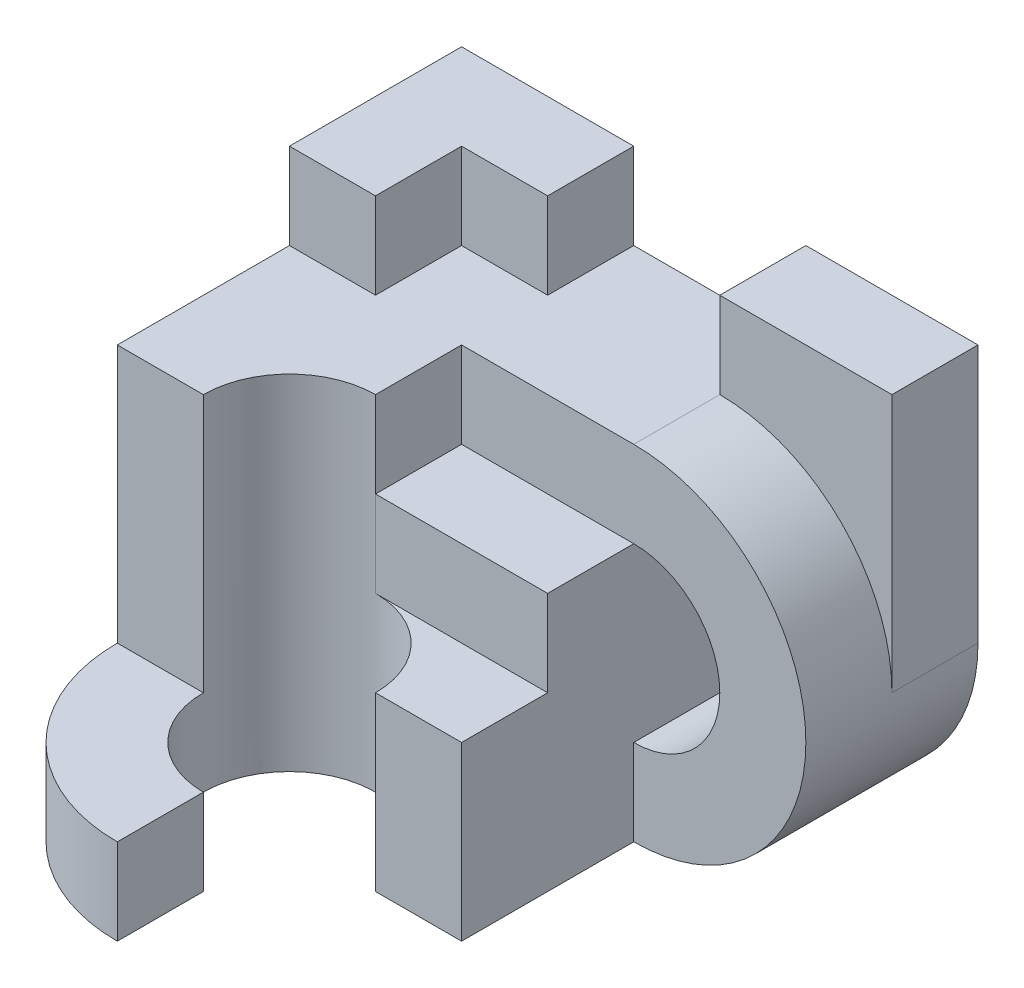
ISO-10303-21;
HEADER;
FILE_DESCRIPTION(('STEP AP214'),'2;1');
FILE_NAME('part.step','',(''),(''),'','','');
FILE_SCHEMA(('AUTOMOTIVE_DESIGN { 1 0 10303 214 1 1 1 1 }'));
ENDSEC;
DATA;
#1=APPLICATION_CONTEXT('core data for automotive mechanical design processes');
#2=APPLICATION_PROTOCOL_DEFINITION('international standard','automotive_design',2000,#1);
#3=PRODUCT_CONTEXT('',#1,'mechanical');
#4=PRODUCT('Part','Part','',(#3));
#5=PRODUCT_RELATED_PRODUCT_CATEGORY('part','',(#4));
#6=PRODUCT_DEFINITION_FORMATION('','',#4);
#7=PRODUCT_DEFINITION_CONTEXT('part definition',#1,'design');
#8=PRODUCT_DEFINITION('design','',#6,#7);
#9=PRODUCT_DEFINITION_SHAPE('','',#8);
#10=(LENGTH_UNIT() NAMED_UNIT(*) SI_UNIT(.MILLI.,.METRE.));
#11=(NAMED_UNIT(*) PLANE_ANGLE_UNIT() SI_UNIT($,.RADIAN.));
#12=(NAMED_UNIT(*) SI_UNIT($,.STERADIAN.) SOLID_ANGLE_UNIT());
#13=UNCERTAINTY_MEASURE_WITH_UNIT(LENGTH_MEASURE(1.E-05),#10,'distance_accuracy_value','');
#14=(GEOMETRIC_REPRESENTATION_CONTEXT(3) GLOBAL_UNCERTAINTY_ASSIGNED_CONTEXT((#13)) GLOBAL_UNIT_ASSIGNED_CONTEXT((#10,
#11,#12)) REPRESENTATION_CONTEXT('',''));
#15=CARTESIAN_POINT('',(0.,0.,0.));
#16=DIRECTION('',(0.,0.,1.));
#17=DIRECTION('',(1.,0.,0.));
#18=AXIS2_PLACEMENT_3D('',#15,#16,#17);
#19=CARTESIAN_POINT('',(7.5,12.5,10.));
#20=DIRECTION('',(0.,-1.,0.));
#21=DIRECTION('',(0.,0.,-1.));
#22=AXIS2_PLACEMENT_3D('',#19,#20,#21);
#23=PLANE('',#22);
#24=DIRECTION('',(1.,0.,0.));
#25=VECTOR('',#24,1.);
#26=CARTESIAN_POINT('',(-7.5,12.5,10.));
#27=LINE('',#26,#25);
#28=CARTESIAN_POINT('',(-12.5,12.5,10.));
#29=VERTEX_POINT('',#28);
#30=CARTESIAN_POINT('',(-7.5,12.5,10.));
#31=VERTEX_POINT('',#30);
#32=EDGE_CURVE('E568',#29,#31,#27,.T.);
#33=ORIENTED_EDGE('',*,*,#32,.F.);
#34=DIRECTION('',(0.,0.,1.));
#35=VECTOR('',#34,1.);
#36=CARTESIAN_POINT('',(-12.5,12.5,0.));
#37=LINE('',#36,#35);
#38=CARTESIAN_POINT('',(-12.5,12.5,20.));
#39=VERTEX_POINT('',#38);
#40=EDGE_CURVE('E222',#29,#39,#37,.T.);
#41=ORIENTED_EDGE('',*,*,#40,.T.);
#42=DIRECTION('',(1.,0.,0.));
#43=VECTOR('',#42,1.);
#44=CARTESIAN_POINT('',(-12.5,12.5,20.));
#45=LINE('',#44,#43);
#46=CARTESIAN_POINT('',(-7.5,12.5,20.));
#47=VERTEX_POINT('',#46);
#48=EDGE_CURVE('E362',#39,#47,#45,.T.);
#49=ORIENTED_EDGE('',*,*,#48,.T.);
#50=CARTESIAN_POINT('',(-2.5,12.5,20.));
#51=DIRECTION('',(0.,-1.,0.));
#52=DIRECTION('',(0.,0.,-1.));
#53=AXIS2_PLACEMENT_3D('',#50,#51,#52);
#54=CIRCLE('',#53,5.);
#55=CARTESIAN_POINT('',(-2.5,12.5,15.));
#56=VERTEX_POINT('',#55);
#57=EDGE_CURVE('E356',#47,#56,#54,.T.);
#58=ORIENTED_EDGE('',*,*,#57,.T.);
#59=DIRECTION('',(0.,0.,-1.));
#60=VECTOR('',#59,1.);
#61=CARTESIAN_POINT('',(-2.5,12.5,0.));
#62=LINE('',#61,#60);
#63=CARTESIAN_POINT('',(-2.5,12.5,10.));
#64=VERTEX_POINT('',#63);
#65=EDGE_CURVE('E339',#56,#64,#62,.T.);
#66=ORIENTED_EDGE('',*,*,#65,.T.);
#67=DIRECTION('',(-1.,0.,0.));
#68=VECTOR('',#67,1.);
#69=CARTESIAN_POINT('',(7.5,12.5,10.));
#70=LINE('',#69,#68);
#71=CARTESIAN_POINT('',(7.5,12.5,10.));
#72=VERTEX_POINT('',#71);
#73=EDGE_CURVE('E517',#72,#64,#70,.T.);
#74=ORIENTED_EDGE('',*,*,#73,.F.);
#75=DIRECTION('',(0.,0.,-1.));
#76=VECTOR('',#75,1.);
#77=CARTESIAN_POINT('',(7.5,12.5,10.));
#78=LINE('',#77,#76);
#79=CARTESIAN_POINT('',(7.5,12.5,5.));
#80=VERTEX_POINT('',#79);
#81=EDGE_CURVE('E477',#72,#80,#78,.T.);
#82=ORIENTED_EDGE('',*,*,#81,.T.);
#83=DIRECTION('',(0.,0.,1.));
#84=VECTOR('',#83,1.);
#85=CARTESIAN_POINT('',(7.5,12.5,10.));
#86=LINE('',#85,#84);
#87=CARTESIAN_POINT('',(7.5,12.5,0.));
#88=VERTEX_POINT('',#87);
#89=EDGE_CURVE('E418',#88,#80,#86,.T.);
#90=ORIENTED_EDGE('',*,*,#89,.F.);
#91=DIRECTION('',(-1.,0.,0.));
#92=VECTOR('',#91,1.);
#93=CARTESIAN_POINT('',(7.5,12.5,0.));
#94=LINE('',#93,#92);
#95=CARTESIAN_POINT('',(-2.5,12.5,0.));
#96=VERTEX_POINT('',#95);
#97=EDGE_CURVE('E529',#88,#96,#94,.T.);
#98=ORIENTED_EDGE('',*,*,#97,.T.);
#99=DIRECTION('',(0.,0.,-1.));
#100=VECTOR('',#99,1.);
#101=CARTESIAN_POINT('',(-2.5,12.5,0.));
#102=LINE('',#101,#100);
#103=CARTESIAN_POINT('',(-2.5,12.5,5.));
#104=VERTEX_POINT('',#103);
#105=EDGE_CURVE('E218',#104,#96,#102,.T.);
#106=ORIENTED_EDGE('',*,*,#105,.F.);
#107=DIRECTION('',(1.,0.,0.));
#108=VECTOR('',#107,1.);
#109=CARTESIAN_POINT('',(-2.5,12.5,5.));
#110=LINE('',#109,#108);
#111=CARTESIAN_POINT('',(-7.5,12.5,5.));
#112=VERTEX_POINT('',#111);
#113=EDGE_CURVE('E53',#112,#104,#110,.T.);
#114=ORIENTED_EDGE('',*,*,#113,.F.);
#115=DIRECTION('',(0.,0.,-1.));
#116=VECTOR('',#115,1.);
#117=CARTESIAN_POINT('',(-7.5,12.5,5.));
#118=LINE('',#117,#116);
#119=EDGE_CURVE('E48',#31,#112,#118,.T.);
#120=ORIENTED_EDGE('',*,*,#119,.F.);
#121=EDGE_LOOP('',(#33,#41,#49,#58,#66,#74,#82,#90,#98,#106,#114,#120));
#122=FACE_BOUND('',#121,.T.);
#123=ADVANCED_FACE('F33',(#122),#23,.F.);
#124=CARTESIAN_POINT('',(7.5,-7.5,15.));
#125=DIRECTION('',(-1.,0.,0.));
#126=DIRECTION('',(0.,0.,1.));
#127=AXIS2_PLACEMENT_3D('',#124,#125,#126);
#128=PLANE('',#127);
#129=DIRECTION('',(0.,1.,0.));
#130=VECTOR('',#129,1.);
#131=CARTESIAN_POINT('',(7.5,-7.5,0.));
#132=LINE('',#131,#130);
#133=CARTESIAN_POINT('',(7.5,-2.5,0.));
#134=VERTEX_POINT('',#133);
#135=CARTESIAN_POINT('',(7.5,7.5,0.));
#136=VERTEX_POINT('',#135);
#137=EDGE_CURVE('E467',#134,#136,#132,.T.);
#138=ORIENTED_EDGE('',*,*,#137,.T.);
#139=DIRECTION('',(0.,0.,1.));
#140=VECTOR('',#139,1.);
#141=CARTESIAN_POINT('',(7.5,7.5,-10.));
#142=LINE('',#141,#140);
#143=CARTESIAN_POINT('',(7.5,7.5,5.));
#144=VERTEX_POINT('',#143);
#145=EDGE_CURVE('E225',#136,#144,#142,.T.);
#146=ORIENTED_EDGE('',*,*,#145,.T.);
#147=DIRECTION('',(0.,0.,-1.));
#148=VECTOR('',#147,1.);
#149=CARTESIAN_POINT('',(7.5,7.5,10.));
#150=LINE('',#149,#148);
#151=CARTESIAN_POINT('',(7.5,7.5,10.));
#152=VERTEX_POINT('',#151);
#153=EDGE_CURVE('E464',#152,#144,#150,.T.);
#154=ORIENTED_EDGE('',*,*,#153,.F.);
#155=DIRECTION('',(0.,0.,-1.));
#156=VECTOR('',#155,1.);
#157=CARTESIAN_POINT('',(7.5,7.5,15.));
#158=LINE('',#157,#156);
#159=CARTESIAN_POINT('',(7.5,7.5,15.));
#160=VERTEX_POINT('',#159);
#161=EDGE_CURVE('E373',#160,#152,#158,.T.);
#162=ORIENTED_EDGE('',*,*,#161,.F.);
#163=DIRECTION('',(0.,1.,0.));
#164=VECTOR('',#163,1.);
#165=CARTESIAN_POINT('',(7.5,-7.5,15.));
#166=LINE('',#165,#164);
#167=CARTESIAN_POINT('',(7.5,2.5,15.));
#168=VERTEX_POINT('',#167);
#169=EDGE_CURVE('E346',#168,#160,#166,.T.);
#170=ORIENTED_EDGE('',*,*,#169,.F.);
#171=DIRECTION('',(0.,0.,-1.));
#172=VECTOR('',#171,1.);
#173=CARTESIAN_POINT('',(7.5,2.5,15.));
#174=LINE('',#173,#172);
#175=CARTESIAN_POINT('',(7.5,2.5,20.));
#176=VERTEX_POINT('',#175);
#177=EDGE_CURVE('E425',#176,#168,#174,.T.);
#178=ORIENTED_EDGE('',*,*,#177,.F.);
#179=DIRECTION('',(0.,-1.,0.));
#180=VECTOR('',#179,1.);
#181=CARTESIAN_POINT('',(7.5,2.5,20.));
#182=LINE('',#181,#180);
#183=CARTESIAN_POINT('',(7.5,-7.5,20.));
#184=VERTEX_POINT('',#183);
#185=EDGE_CURVE('E415',#176,#184,#182,.T.);
#186=ORIENTED_EDGE('',*,*,#185,.T.);
#187=DIRECTION('',(0.,0.,-1.));
#188=VECTOR('',#187,1.);
#189=CARTESIAN_POINT('',(7.5,-7.5,15.));
#190=LINE('',#189,#188);
#191=CARTESIAN_POINT('',(7.5,-7.5,10.));
#192=VERTEX_POINT('',#191);
#193=EDGE_CURVE('E347',#184,#192,#190,.T.);
#194=ORIENTED_EDGE('',*,*,#193,.T.);
#195=DIRECTION('',(0.,-1.,0.));
#196=VECTOR('',#195,1.);
#197=CARTESIAN_POINT('',(7.5,-2.5,10.));
#198=LINE('',#197,#196);
#199=CARTESIAN_POINT('',(7.5,-2.5,10.));
#200=VERTEX_POINT('',#199);
#201=EDGE_CURVE('E525',#200,#192,#198,.T.);
#202=ORIENTED_EDGE('',*,*,#201,.F.);
#203=DIRECTION('',(0.,0.,-1.));
#204=VECTOR('',#203,1.);
#205=CARTESIAN_POINT('',(7.5,-2.5,10.));
#206=LINE('',#205,#204);
#207=EDGE_CURVE('E478',#200,#134,#206,.T.);
#208=ORIENTED_EDGE('',*,*,#207,.T.);
#209=EDGE_LOOP('',(#138,#146,#154,#162,#170,#178,#186,#194,#202,#208));
#210=FACE_BOUND('',#209,.T.);
#211=ADVANCED_FACE('F35',(#210),#128,.F.);
#212=CARTESIAN_POINT('',(7.49999999999999,2.5,10.));
#213=DIRECTION('',(0.,0.,-1.));
#214=DIRECTION('',(-1.,0.,0.));
#215=AXIS2_PLACEMENT_3D('',#212,#213,#214);
#216=CYLINDRICAL_SURFACE('',#215,10.);
#217=CARTESIAN_POINT('',(7.49999999999999,2.5,5.));
#218=DIRECTION('',(0.,0.,-1.));
#219=DIRECTION('',(-1.,0.,0.));
#220=AXIS2_PLACEMENT_3D('',#217,#218,#219);
#221=CIRCLE('',#220,10.);
#222=CARTESIAN_POINT('',(17.5,2.5,5.));
#223=VERTEX_POINT('',#222);
#224=EDGE_CURVE('E421',#80,#223,#221,.T.);
#225=ORIENTED_EDGE('',*,*,#224,.F.);
#226=ORIENTED_EDGE('',*,*,#81,.F.);
#227=CARTESIAN_POINT('',(7.49999999999999,2.5,10.));
#228=DIRECTION('',(0.,0.,1.));
#229=DIRECTION('',(1.,0.,0.));
#230=AXIS2_PLACEMENT_3D('',#227,#228,#229);
#231=CIRCLE('',#230,10.);
#232=EDGE_CURVE('E514',#192,#72,#231,.T.);
#233=ORIENTED_EDGE('',*,*,#232,.F.);
#234=DIRECTION('',(0.,0.,-1.));
#235=VECTOR('',#234,1.);
#236=CARTESIAN_POINT('',(7.5,-7.5,10.));
#237=LINE('',#236,#235);
#238=CARTESIAN_POINT('',(7.5,-7.5,0.));
#239=VERTEX_POINT('',#238);
#240=EDGE_CURVE('E482',#192,#239,#237,.T.);
#241=ORIENTED_EDGE('',*,*,#240,.T.);
#242=CARTESIAN_POINT('',(7.49999999999999,2.5,0.));
#243=DIRECTION('',(0.,0.,1.));
#244=DIRECTION('',(1.,0.,0.));
#245=AXIS2_PLACEMENT_3D('',#242,#243,#244);
#246=CIRCLE('',#245,10.);
#247=CARTESIAN_POINT('',(17.5,2.5,0.));
#248=VERTEX_POINT('',#247);
#249=EDGE_CURVE('E513',#239,#248,#246,.T.);
#250=ORIENTED_EDGE('',*,*,#249,.T.);
#251=DIRECTION('',(0.,0.,-1.));
#252=VECTOR('',#251,1.);
#253=CARTESIAN_POINT('',(17.5,2.5,0.));
#254=LINE('',#253,#252);
#255=EDGE_CURVE('E444',#223,#248,#254,.T.);
#256=ORIENTED_EDGE('',*,*,#255,.F.);
#257=EDGE_LOOP('',(#225,#226,#233,#241,#250,#256));
#258=FACE_BOUND('',#257,.T.);
#259=ADVANCED_FACE('F307',(#258),#216,.T.);
#260=CARTESIAN_POINT('',(7.49999999999999,2.5,10.));
#261=DIRECTION('',(0.,0.,-1.));
#262=DIRECTION('',(-1.,0.,0.));
#263=AXIS2_PLACEMENT_3D('',#260,#261,#262);
#264=CYLINDRICAL_SURFACE('',#263,5.);
#265=CARTESIAN_POINT('',(7.49999999999999,2.5,5.));
#266=DIRECTION('',(0.,0.,-1.));
#267=DIRECTION('',(-1.,0.,0.));
#268=AXIS2_PLACEMENT_3D('',#265,#266,#267);
#269=CIRCLE('',#268,5.);
#270=CARTESIAN_POINT('',(12.5,2.5,5.));
#271=VERTEX_POINT('',#270);
#272=EDGE_CURVE('E11',#271,#144,#269,.F.);
#273=ORIENTED_EDGE('',*,*,#272,.F.);
#274=DIRECTION('',(0.,0.,-1.));
#275=VECTOR('',#274,1.);
#276=CARTESIAN_POINT('',(12.5,2.5,10.));
#277=LINE('',#276,#275);
#278=CARTESIAN_POINT('',(12.5,2.5,0.));
#279=VERTEX_POINT('',#278);
#280=EDGE_CURVE('E41',#271,#279,#277,.T.);
#281=ORIENTED_EDGE('',*,*,#280,.T.);
#282=CARTESIAN_POINT('',(7.49999999999999,2.5,0.));
#283=DIRECTION('',(0.,0.,-1.));
#284=DIRECTION('',(1.,0.,0.));
#285=AXIS2_PLACEMENT_3D('',#282,#283,#284);
#286=CIRCLE('',#285,5.);
#287=EDGE_CURVE('E518',#279,#134,#286,.T.);
#288=ORIENTED_EDGE('',*,*,#287,.T.);
#289=ORIENTED_EDGE('',*,*,#207,.F.);
#290=CARTESIAN_POINT('',(7.49999999999999,2.5,10.));
#291=DIRECTION('',(0.,0.,-1.));
#292=DIRECTION('',(1.,0.,0.));
#293=AXIS2_PLACEMENT_3D('',#290,#291,#292);
#294=CIRCLE('',#293,5.);
#295=EDGE_CURVE('E476',#152,#200,#294,.T.);
#296=ORIENTED_EDGE('',*,*,#295,.F.);
#297=ORIENTED_EDGE('',*,*,#153,.T.);
#298=EDGE_LOOP('',(#273,#281,#288,#289,#296,#297));
#299=FACE_BOUND('',#298,.T.);
#300=ADVANCED_FACE('F292',(#299),#264,.F.);
#301=CARTESIAN_POINT('',(-12.5,12.5,20.));
#302=DIRECTION('',(0.,0.,-1.));
#303=DIRECTION('',(-1.,0.,0.));
#304=AXIS2_PLACEMENT_3D('',#301,#302,#303);
#305=PLANE('',#304);
#306=DIRECTION('',(-1.,0.,0.));
#307=VECTOR('',#306,1.);
#308=CARTESIAN_POINT('',(-12.5,-2.5,20.));
#309=LINE('',#308,#307);
#310=CARTESIAN_POINT('',(-7.5,-2.5,20.));
#311=VERTEX_POINT('',#310);
#312=CARTESIAN_POINT('',(-12.5,-2.5,20.));
#313=VERTEX_POINT('',#312);
#314=EDGE_CURVE('E377',#311,#313,#309,.T.);
#315=ORIENTED_EDGE('',*,*,#314,.F.);
#316=DIRECTION('',(0.,-1.,0.));
#317=VECTOR('',#316,1.);
#318=CARTESIAN_POINT('',(-7.5,12.5,20.));
#319=LINE('',#318,#317);
#320=EDGE_CURVE('E355',#47,#311,#319,.T.);
#321=ORIENTED_EDGE('',*,*,#320,.F.);
#322=ORIENTED_EDGE('',*,*,#48,.F.);
#323=DIRECTION('',(0.,-1.,0.));
#324=VECTOR('',#323,1.);
#325=CARTESIAN_POINT('',(-12.5,12.5,20.));
#326=LINE('',#325,#324);
#327=EDGE_CURVE('E359',#39,#313,#326,.T.);
#328=ORIENTED_EDGE('',*,*,#327,.T.);
#329=EDGE_LOOP('',(#315,#321,#322,#328));
#330=FACE_BOUND('',#329,.T.);
#331=ADVANCED_FACE('F288',(#330),#305,.F.);
#332=CARTESIAN_POINT('',(-7.5,7.5,15.));
#333=DIRECTION('',(0.,-1.,0.));
#334=DIRECTION('',(0.,0.,-1.));
#335=AXIS2_PLACEMENT_3D('',#332,#333,#334);
#336=PLANE('',#335);
#337=DIRECTION('',(0.,0.,-1.));
#338=VECTOR('',#337,1.);
#339=CARTESIAN_POINT('',(-2.5,7.5,0.));
#340=LINE('',#339,#338);
#341=CARTESIAN_POINT('',(-2.5,7.5,15.));
#342=VERTEX_POINT('',#341);
#343=CARTESIAN_POINT('',(-2.5,7.5,10.));
#344=VERTEX_POINT('',#343);
#345=EDGE_CURVE('E331',#342,#344,#340,.T.);
#346=ORIENTED_EDGE('',*,*,#345,.F.);
#347=DIRECTION('',(-1.,0.,0.));
#348=VECTOR('',#347,1.);
#349=CARTESIAN_POINT('',(-7.5,7.5,15.));
#350=LINE('',#349,#348);
#351=EDGE_CURVE('E334',#160,#342,#350,.T.);
#352=ORIENTED_EDGE('',*,*,#351,.F.);
#353=ORIENTED_EDGE('',*,*,#161,.T.);
#354=DIRECTION('',(1.,0.,0.));
#355=VECTOR('',#354,1.);
#356=CARTESIAN_POINT('',(7.5,7.5,10.));
#357=LINE('',#356,#355);
#358=EDGE_CURVE('E337',#344,#152,#357,.T.);
#359=ORIENTED_EDGE('',*,*,#358,.F.);
#360=EDGE_LOOP('',(#346,#352,#353,#359));
#361=FACE_BOUND('',#360,.T.);
#362=ADVANCED_FACE('F291',(#361),#336,.F.);
#363=CARTESIAN_POINT('',(-7.5,-7.5,15.));
#364=DIRECTION('',(0.,1.,0.));
#365=DIRECTION('',(0.,0.,1.));
#366=AXIS2_PLACEMENT_3D('',#363,#364,#365);
#367=PLANE('',#366);
#368=DIRECTION('',(1.,0.,0.));
#369=VECTOR('',#368,1.);
#370=CARTESIAN_POINT('',(-7.5,-7.5,0.));
#371=LINE('',#370,#369);
#372=CARTESIAN_POINT('',(-12.5,-7.5,0.));
#373=VERTEX_POINT('',#372);
#374=EDGE_CURVE('E486',#373,#239,#371,.T.);
#375=ORIENTED_EDGE('',*,*,#374,.T.);
#376=ORIENTED_EDGE('',*,*,#240,.F.);
#377=ORIENTED_EDGE('',*,*,#193,.F.);
#378=DIRECTION('',(1.,0.,0.));
#379=VECTOR('',#378,1.);
#380=CARTESIAN_POINT('',(7.5,-7.5,20.));
#381=LINE('',#380,#379);
#382=CARTESIAN_POINT('',(2.5,-7.5,20.));
#383=VERTEX_POINT('',#382);
#384=EDGE_CURVE('E412',#383,#184,#381,.T.);
#385=ORIENTED_EDGE('',*,*,#384,.F.);
#386=CARTESIAN_POINT('',(-2.5,-7.5,20.));
#387=DIRECTION('',(0.,-1.,0.));
#388=DIRECTION('',(0.,0.,-1.));
#389=AXIS2_PLACEMENT_3D('',#386,#387,#388);
#390=CIRCLE('',#389,5.);
#391=CARTESIAN_POINT('',(-2.5,-7.5,25.));
#392=VERTEX_POINT('',#391);
#393=EDGE_CURVE('E366',#392,#383,#390,.T.);
#394=ORIENTED_EDGE('',*,*,#393,.F.);
#395=DIRECTION('',(0.,0.,-1.));
#396=VECTOR('',#395,1.);
#397=CARTESIAN_POINT('',(-2.5,-7.5,25.));
#398=LINE('',#397,#396);
#399=CARTESIAN_POINT('',(-2.5,-7.5,30.));
#400=VERTEX_POINT('',#399);
#401=EDGE_CURVE('E392',#400,#392,#398,.T.);
#402=ORIENTED_EDGE('',*,*,#401,.F.);
#403=CARTESIAN_POINT('',(-2.5,-7.5,20.));
#404=DIRECTION('',(0.,1.,0.));
#405=DIRECTION('',(0.,0.,1.));
#406=AXIS2_PLACEMENT_3D('',#403,#404,#405);
#407=CIRCLE('',#406,10.);
#408=CARTESIAN_POINT('',(-12.5,-7.5,20.));
#409=VERTEX_POINT('',#408);
#410=EDGE_CURVE('E389',#409,#400,#407,.T.);
#411=ORIENTED_EDGE('',*,*,#410,.F.);
#412=DIRECTION('',(0.,0.,1.));
#413=VECTOR('',#412,1.);
#414=CARTESIAN_POINT('',(-12.5,-7.5,0.));
#415=LINE('',#414,#413);
#416=EDGE_CURVE('E376',#373,#409,#415,.T.);
#417=ORIENTED_EDGE('',*,*,#416,.F.);
#418=EDGE_LOOP('',(#375,#376,#377,#385,#394,#402,#411,#417));
#419=FACE_BOUND('',#418,.T.);
#420=ADVANCED_FACE('F317',(#419),#367,.F.);
#421=CARTESIAN_POINT('',(0.,0.,15.));
#422=DIRECTION('',(0.,0.,-1.));
#423=DIRECTION('',(-1.,0.,0.));
#424=AXIS2_PLACEMENT_3D('',#421,#422,#423);
#425=PLANE('',#424);
#426=DIRECTION('',(0.,-1.,0.));
#427=VECTOR('',#426,1.);
#428=CARTESIAN_POINT('',(-2.5,12.5,15.));
#429=LINE('',#428,#427);
#430=CARTESIAN_POINT('',(-2.5,2.5,15.));
#431=VERTEX_POINT('',#430);
#432=EDGE_CURVE('E343',#342,#431,#429,.T.);
#433=ORIENTED_EDGE('',*,*,#432,.T.);
#434=DIRECTION('',(-1.,0.,0.));
#435=VECTOR('',#434,1.);
#436=CARTESIAN_POINT('',(-2.5,2.5,15.));
#437=LINE('',#436,#435);
#438=EDGE_CURVE('E417',#168,#431,#437,.T.);
#439=ORIENTED_EDGE('',*,*,#438,.F.);
#440=ORIENTED_EDGE('',*,*,#169,.T.);
#441=ORIENTED_EDGE('',*,*,#351,.T.);
#442=EDGE_LOOP('',(#433,#439,#440,#441));
#443=FACE_BOUND('',#442,.T.);
#444=ADVANCED_FACE('F314',(#443),#425,.F.);
#445=CARTESIAN_POINT('',(0.,0.,0.));
#446=DIRECTION('',(0.,0.,-1.));
#447=DIRECTION('',(-1.,0.,0.));
#448=AXIS2_PLACEMENT_3D('',#445,#446,#447);
#449=PLANE('',#448);
#450=CARTESIAN_POINT('',(12.5,2.5,0.));
#451=CARTESIAN_POINT('',(11.0355339059327,7.49999999999999,0.));
#452=CARTESIAN_POINT('',(7.5,7.5,0.));
#453=B_SPLINE_CURVE_WITH_KNOTS('',2,(#450,#451,#452),.UNSPECIFIED.,.F.,.F.,(3,3),(0.,1.),.UNSPECIFIED.);
#454=EDGE_CURVE('E448',#136,#279,#453,.F.);
#455=ORIENTED_EDGE('',*,*,#454,.F.);
#456=ORIENTED_EDGE('',*,*,#137,.F.);
#457=ORIENTED_EDGE('',*,*,#287,.F.);
#458=EDGE_LOOP('',(#455,#456,#457));
#459=FACE_BOUND('',#458,.T.);
#460=ORIENTED_EDGE('',*,*,#97,.F.);
#461=DIRECTION('',(0.,-1.,0.));
#462=VECTOR('',#461,1.);
#463=CARTESIAN_POINT('',(7.5,17.5,0.));
#464=LINE('',#463,#462);
#465=CARTESIAN_POINT('',(7.5,17.5,0.));
#466=VERTEX_POINT('',#465);
#467=EDGE_CURVE('E435',#466,#88,#464,.T.);
#468=ORIENTED_EDGE('',*,*,#467,.F.);
#469=DIRECTION('',(-1.,0.,0.));
#470=VECTOR('',#469,1.);
#471=CARTESIAN_POINT('',(17.5,17.5,0.));
#472=LINE('',#471,#470);
#473=CARTESIAN_POINT('',(17.5,17.5,0.));
#474=VERTEX_POINT('',#473);
#475=EDGE_CURVE('E452',#474,#466,#472,.T.);
#476=ORIENTED_EDGE('',*,*,#475,.F.);
#477=DIRECTION('',(0.,-1.,0.));
#478=VECTOR('',#477,1.);
#479=CARTESIAN_POINT('',(17.5,17.5,0.));
#480=LINE('',#479,#478);
#481=EDGE_CURVE('E433',#474,#248,#480,.T.);
#482=ORIENTED_EDGE('',*,*,#481,.T.);
#483=ORIENTED_EDGE('',*,*,#249,.F.);
#484=ORIENTED_EDGE('',*,*,#374,.F.);
#485=DIRECTION('',(0.,-1.,0.));
#486=VECTOR('',#485,1.);
#487=CARTESIAN_POINT('',(-12.5,12.5,0.));
#488=LINE('',#487,#486);
#489=CARTESIAN_POINT('',(-12.5,17.5,0.));
#490=VERTEX_POINT('',#489);
#491=EDGE_CURVE('E340',#490,#373,#488,.T.);
#492=ORIENTED_EDGE('',*,*,#491,.F.);
#493=DIRECTION('',(-1.,0.,0.));
#494=VECTOR('',#493,1.);
#495=CARTESIAN_POINT('',(-12.5,17.5,0.));
#496=LINE('',#495,#494);
#497=CARTESIAN_POINT('',(-2.5,17.5,0.));
#498=VERTEX_POINT('',#497);
#499=EDGE_CURVE('E215',#498,#490,#496,.T.);
#500=ORIENTED_EDGE('',*,*,#499,.F.);
#501=DIRECTION('',(0.,-1.,0.));
#502=VECTOR('',#501,1.);
#503=CARTESIAN_POINT('',(-2.5,17.5,0.));
#504=LINE('',#503,#502);
#505=EDGE_CURVE('E548',#498,#96,#504,.T.);
#506=ORIENTED_EDGE('',*,*,#505,.T.);
#507=EDGE_LOOP('',(#460,#468,#476,#482,#483,#484,#492,#500,#506));
#508=FACE_BOUND('',#507,.T.);
#509=ADVANCED_FACE('F303',(#459,#508),#449,.T.);
#510=CARTESIAN_POINT('',(7.49999999999999,2.5,10.));
#511=DIRECTION('',(0.,0.,1.));
#512=DIRECTION('',(1.,0.,0.));
#513=AXIS2_PLACEMENT_3D('',#510,#511,#512);
#514=PLANE('',#513);
#515=ORIENTED_EDGE('',*,*,#232,.T.);
#516=ORIENTED_EDGE('',*,*,#73,.T.);
#517=DIRECTION('',(0.,-1.,0.));
#518=VECTOR('',#517,1.);
#519=CARTESIAN_POINT('',(-2.5,12.5,10.));
#520=LINE('',#519,#518);
#521=EDGE_CURVE('E521',#64,#344,#520,.T.);
#522=ORIENTED_EDGE('',*,*,#521,.T.);
#523=ORIENTED_EDGE('',*,*,#358,.T.);
#524=ORIENTED_EDGE('',*,*,#295,.T.);
#525=ORIENTED_EDGE('',*,*,#201,.T.);
#526=EDGE_LOOP('',(#515,#516,#522,#523,#524,#525));
#527=FACE_BOUND('',#526,.T.);
#528=ADVANCED_FACE('F299',(#527),#514,.T.);
#529=CARTESIAN_POINT('',(-2.5,12.5,0.));
#530=DIRECTION('',(-1.,0.,0.));
#531=DIRECTION('',(0.,0.,1.));
#532=AXIS2_PLACEMENT_3D('',#529,#530,#531);
#533=PLANE('',#532);
#534=ORIENTED_EDGE('',*,*,#521,.F.);
#535=ORIENTED_EDGE('',*,*,#65,.F.);
#536=DIRECTION('',(0.,-1.,0.));
#537=VECTOR('',#536,1.);
#538=CARTESIAN_POINT('',(-2.5,12.5,15.));
#539=LINE('',#538,#537);
#540=EDGE_CURVE('E351',#56,#342,#539,.T.);
#541=ORIENTED_EDGE('',*,*,#540,.T.);
#542=ORIENTED_EDGE('',*,*,#345,.T.);
#543=EDGE_LOOP('',(#534,#535,#541,#542));
#544=FACE_BOUND('',#543,.T.);
#545=ADVANCED_FACE('F296',(#544),#533,.F.);
#546=CARTESIAN_POINT('',(-12.5,12.5,0.));
#547=DIRECTION('',(1.,0.,0.));
#548=DIRECTION('',(0.,0.,-1.));
#549=AXIS2_PLACEMENT_3D('',#546,#547,#548);
#550=PLANE('',#549);
#551=ORIENTED_EDGE('',*,*,#416,.T.);
#552=DIRECTION('',(0.,-1.,0.));
#553=VECTOR('',#552,1.);
#554=CARTESIAN_POINT('',(-12.5,-2.5,20.));
#555=LINE('',#554,#553);
#556=EDGE_CURVE('E381',#313,#409,#555,.T.);
#557=ORIENTED_EDGE('',*,*,#556,.F.);
#558=ORIENTED_EDGE('',*,*,#327,.F.);
#559=ORIENTED_EDGE('',*,*,#40,.F.);
#560=DIRECTION('',(0.,-1.,0.));
#561=VECTOR('',#560,1.);
#562=CARTESIAN_POINT('',(-12.5,17.5,10.));
#563=LINE('',#562,#561);
#564=CARTESIAN_POINT('',(-12.5,17.5,10.));
#565=VERTEX_POINT('',#564);
#566=EDGE_CURVE('E203',#565,#29,#563,.T.);
#567=ORIENTED_EDGE('',*,*,#566,.F.);
#568=DIRECTION('',(0.,0.,1.));
#569=VECTOR('',#568,1.);
#570=CARTESIAN_POINT('',(-12.5,17.5,10.));
#571=LINE('',#570,#569);
#572=EDGE_CURVE('E209',#490,#565,#571,.T.);
#573=ORIENTED_EDGE('',*,*,#572,.F.);
#574=ORIENTED_EDGE('',*,*,#491,.T.);
#575=EDGE_LOOP('',(#551,#557,#558,#559,#567,#573,#574));
#576=FACE_BOUND('',#575,.T.);
#577=ADVANCED_FACE('F220',(#576),#550,.F.);
#578=CARTESIAN_POINT('',(-2.5,12.5,20.));
#579=DIRECTION('',(0.,-1.,0.));
#580=DIRECTION('',(0.,0.,-1.));
#581=AXIS2_PLACEMENT_3D('',#578,#579,#580);
#582=CYLINDRICAL_SURFACE('',#581,5.);
#583=ORIENTED_EDGE('',*,*,#393,.T.);
#584=DIRECTION('',(0.,-1.,0.));
#585=VECTOR('',#584,1.);
#586=CARTESIAN_POINT('',(2.5,2.5,20.));
#587=LINE('',#586,#585);
#588=CARTESIAN_POINT('',(2.5,2.5,20.));
#589=VERTEX_POINT('',#588);
#590=EDGE_CURVE('E393',#589,#383,#587,.T.);
#591=ORIENTED_EDGE('',*,*,#590,.F.);
#592=CARTESIAN_POINT('',(-2.5,2.5,20.));
#593=DIRECTION('',(0.,-1.,0.));
#594=DIRECTION('',(0.,0.,1.));
#595=AXIS2_PLACEMENT_3D('',#592,#593,#594);
#596=CIRCLE('',#595,5.);
#597=EDGE_CURVE('E353',#431,#589,#596,.T.);
#598=ORIENTED_EDGE('',*,*,#597,.F.);
#599=ORIENTED_EDGE('',*,*,#432,.F.);
#600=ORIENTED_EDGE('',*,*,#540,.F.);
#601=ORIENTED_EDGE('',*,*,#57,.F.);
#602=ORIENTED_EDGE('',*,*,#320,.T.);
#603=CARTESIAN_POINT('',(-2.5,-2.5,20.));
#604=DIRECTION('',(0.,-1.,0.));
#605=DIRECTION('',(0.,0.,1.));
#606=AXIS2_PLACEMENT_3D('',#603,#604,#605);
#607=CIRCLE('',#606,5.);
#608=CARTESIAN_POINT('',(-2.5,-2.5,25.));
#609=VERTEX_POINT('',#608);
#610=EDGE_CURVE('E382',#609,#311,#607,.T.);
#611=ORIENTED_EDGE('',*,*,#610,.F.);
#612=DIRECTION('',(0.,-1.,0.));
#613=VECTOR('',#612,1.);
#614=CARTESIAN_POINT('',(-2.5,-2.5,25.));
#615=LINE('',#614,#613);
#616=EDGE_CURVE('E397',#609,#392,#615,.T.);
#617=ORIENTED_EDGE('',*,*,#616,.T.);
#618=EDGE_LOOP('',(#583,#591,#598,#599,#600,#601,#602,#611,#617));
#619=FACE_BOUND('',#618,.T.);
#620=ADVANCED_FACE('F283',(#619),#582,.F.);
#621=CARTESIAN_POINT('',(-2.5,-2.5,20.));
#622=DIRECTION('',(0.,-1.,0.));
#623=DIRECTION('',(0.,0.,-1.));
#624=AXIS2_PLACEMENT_3D('',#621,#622,#623);
#625=CYLINDRICAL_SURFACE('',#624,10.);
#626=ORIENTED_EDGE('',*,*,#410,.T.);
#627=DIRECTION('',(0.,-1.,0.));
#628=VECTOR('',#627,1.);
#629=CARTESIAN_POINT('',(-2.5,-2.5,30.));
#630=LINE('',#629,#628);
#631=CARTESIAN_POINT('',(-2.5,-2.5,30.));
#632=VERTEX_POINT('',#631);
#633=EDGE_CURVE('E400',#632,#400,#630,.T.);
#634=ORIENTED_EDGE('',*,*,#633,.F.);
#635=CARTESIAN_POINT('',(-2.5,-2.5,20.));
#636=DIRECTION('',(0.,1.,0.));
#637=DIRECTION('',(0.,0.,1.));
#638=AXIS2_PLACEMENT_3D('',#635,#636,#637);
#639=CIRCLE('',#638,10.);
#640=EDGE_CURVE('E396',#313,#632,#639,.T.);
#641=ORIENTED_EDGE('',*,*,#640,.F.);
#642=ORIENTED_EDGE('',*,*,#556,.T.);
#643=EDGE_LOOP('',(#626,#634,#641,#642));
#644=FACE_BOUND('',#643,.T.);
#645=ADVANCED_FACE('F279',(#644),#625,.T.);
#646=CARTESIAN_POINT('',(-2.5,-2.5,25.));
#647=DIRECTION('',(-1.,0.,0.));
#648=DIRECTION('',(0.,0.,1.));
#649=AXIS2_PLACEMENT_3D('',#646,#647,#648);
#650=PLANE('',#649);
#651=ORIENTED_EDGE('',*,*,#401,.T.);
#652=ORIENTED_EDGE('',*,*,#616,.F.);
#653=DIRECTION('',(0.,0.,-1.));
#654=VECTOR('',#653,1.);
#655=CARTESIAN_POINT('',(-2.5,-2.5,25.));
#656=LINE('',#655,#654);
#657=EDGE_CURVE('E387',#632,#609,#656,.T.);
#658=ORIENTED_EDGE('',*,*,#657,.F.);
#659=ORIENTED_EDGE('',*,*,#633,.T.);
#660=EDGE_LOOP('',(#651,#652,#658,#659));
#661=FACE_BOUND('',#660,.T.);
#662=ADVANCED_FACE('F275',(#661),#650,.F.);
#663=CARTESIAN_POINT('',(-2.5,-2.5,20.));
#664=DIRECTION('',(0.,1.,0.));
#665=DIRECTION('',(0.,0.,1.));
#666=AXIS2_PLACEMENT_3D('',#663,#664,#665);
#667=PLANE('',#666);
#668=ORIENTED_EDGE('',*,*,#640,.T.);
#669=ORIENTED_EDGE('',*,*,#657,.T.);
#670=ORIENTED_EDGE('',*,*,#610,.T.);
#671=ORIENTED_EDGE('',*,*,#314,.T.);
#672=EDGE_LOOP('',(#668,#669,#670,#671));
#673=FACE_BOUND('',#672,.T.);
#674=ADVANCED_FACE('F271',(#673),#667,.T.);
#675=CARTESIAN_POINT('',(7.5,2.5,20.));
#676=DIRECTION('',(0.,0.,-1.));
#677=DIRECTION('',(-1.,0.,0.));
#678=AXIS2_PLACEMENT_3D('',#675,#676,#677);
#679=PLANE('',#678);
#680=ORIENTED_EDGE('',*,*,#384,.T.);
#681=ORIENTED_EDGE('',*,*,#185,.F.);
#682=DIRECTION('',(1.,0.,0.));
#683=VECTOR('',#682,1.);
#684=CARTESIAN_POINT('',(7.5,2.5,20.));
#685=LINE('',#684,#683);
#686=EDGE_CURVE('E414',#589,#176,#685,.T.);
#687=ORIENTED_EDGE('',*,*,#686,.F.);
#688=ORIENTED_EDGE('',*,*,#590,.T.);
#689=EDGE_LOOP('',(#680,#681,#687,#688));
#690=FACE_BOUND('',#689,.T.);
#691=ADVANCED_FACE('F267',(#690),#679,.F.);
#692=CARTESIAN_POINT('',(-2.5,2.5,20.));
#693=DIRECTION('',(0.,1.,0.));
#694=DIRECTION('',(0.,0.,1.));
#695=AXIS2_PLACEMENT_3D('',#692,#693,#694);
#696=PLANE('',#695);
#697=ORIENTED_EDGE('',*,*,#438,.T.);
#698=ORIENTED_EDGE('',*,*,#597,.T.);
#699=ORIENTED_EDGE('',*,*,#686,.T.);
#700=ORIENTED_EDGE('',*,*,#177,.T.);
#701=EDGE_LOOP('',(#697,#698,#699,#700));
#702=FACE_BOUND('',#701,.T.);
#703=ADVANCED_FACE('F264',(#702),#696,.T.);
#704=CARTESIAN_POINT('',(17.5,17.5,5.));
#705=DIRECTION('',(0.,0.,-1.));
#706=DIRECTION('',(-1.,0.,0.));
#707=AXIS2_PLACEMENT_3D('',#704,#705,#706);
#708=PLANE('',#707);
#709=ORIENTED_EDGE('',*,*,#272,.T.);
#710=CARTESIAN_POINT('',(12.5,2.5,5.));
#711=CARTESIAN_POINT('',(11.0355339059327,7.49999999999999,5.));
#712=CARTESIAN_POINT('',(7.5,7.5,5.));
#713=B_SPLINE_CURVE_WITH_KNOTS('',2,(#710,#711,#712),.UNSPECIFIED.,.F.,.F.,(3,3),(0.,1.),.UNSPECIFIED.);
#714=EDGE_CURVE('E223',#271,#144,#713,.T.);
#715=ORIENTED_EDGE('',*,*,#714,.F.);
#716=EDGE_LOOP('',(#709,#715));
#717=FACE_BOUND('',#716,.T.);
#718=ADVANCED_FACE('F257',(#717),#708,.F.);
#719=CARTESIAN_POINT('',(7.5,17.5,0.));
#720=DIRECTION('',(1.,0.,0.));
#721=DIRECTION('',(0.,0.,-1.));
#722=AXIS2_PLACEMENT_3D('',#719,#720,#721);
#723=PLANE('',#722);
#724=ORIENTED_EDGE('',*,*,#467,.T.);
#725=ORIENTED_EDGE('',*,*,#89,.T.);
#726=DIRECTION('',(0.,-1.,0.));
#727=VECTOR('',#726,1.);
#728=CARTESIAN_POINT('',(7.5,17.5,5.));
#729=LINE('',#728,#727);
#730=CARTESIAN_POINT('',(7.5,17.5,5.));
#731=VERTEX_POINT('',#730);
#732=EDGE_CURVE('E437',#731,#80,#729,.T.);
#733=ORIENTED_EDGE('',*,*,#732,.F.);
#734=DIRECTION('',(0.,0.,1.));
#735=VECTOR('',#734,1.);
#736=CARTESIAN_POINT('',(7.5,17.5,0.));
#737=LINE('',#736,#735);
#738=EDGE_CURVE('E450',#466,#731,#737,.T.);
#739=ORIENTED_EDGE('',*,*,#738,.F.);
#740=EDGE_LOOP('',(#724,#725,#733,#739));
#741=FACE_BOUND('',#740,.T.);
#742=ADVANCED_FACE('F255',(#741),#723,.F.);
#743=ORIENTED_EDGE('',*,*,#732,.T.);
#744=ORIENTED_EDGE('',*,*,#224,.T.);
#745=DIRECTION('',(0.,-1.,0.));
#746=VECTOR('',#745,1.);
#747=CARTESIAN_POINT('',(17.5,17.5,5.));
#748=LINE('',#747,#746);
#749=CARTESIAN_POINT('',(17.5,17.5,5.));
#750=VERTEX_POINT('',#749);
#751=EDGE_CURVE('E440',#750,#223,#748,.T.);
#752=ORIENTED_EDGE('',*,*,#751,.F.);
#753=DIRECTION('',(1.,0.,0.));
#754=VECTOR('',#753,1.);
#755=CARTESIAN_POINT('',(17.5,17.5,5.));
#756=LINE('',#755,#754);
#757=EDGE_CURVE('E443',#731,#750,#756,.T.);
#758=ORIENTED_EDGE('',*,*,#757,.F.);
#759=EDGE_LOOP('',(#743,#744,#752,#758));
#760=FACE_BOUND('',#759,.T.);
#761=ADVANCED_FACE('F252',(#760),#708,.F.);
#762=CARTESIAN_POINT('',(17.5,17.5,0.));
#763=DIRECTION('',(-1.,0.,0.));
#764=DIRECTION('',(0.,0.,1.));
#765=AXIS2_PLACEMENT_3D('',#762,#763,#764);
#766=PLANE('',#765);
#767=ORIENTED_EDGE('',*,*,#255,.T.);
#768=ORIENTED_EDGE('',*,*,#481,.F.);
#769=DIRECTION('',(0.,0.,-1.));
#770=VECTOR('',#769,1.);
#771=CARTESIAN_POINT('',(17.5,17.5,0.));
#772=LINE('',#771,#770);
#773=EDGE_CURVE('E447',#750,#474,#772,.T.);
#774=ORIENTED_EDGE('',*,*,#773,.F.);
#775=ORIENTED_EDGE('',*,*,#751,.T.);
#776=EDGE_LOOP('',(#767,#768,#774,#775));
#777=FACE_BOUND('',#776,.T.);
#778=ADVANCED_FACE('F250',(#777),#766,.F.);
#779=CARTESIAN_POINT('',(0.,17.5,0.));
#780=DIRECTION('',(0.,-1.,0.));
#781=DIRECTION('',(0.,0.,-1.));
#782=AXIS2_PLACEMENT_3D('',#779,#780,#781);
#783=PLANE('',#782);
#784=ORIENTED_EDGE('',*,*,#773,.T.);
#785=ORIENTED_EDGE('',*,*,#475,.T.);
#786=ORIENTED_EDGE('',*,*,#738,.T.);
#787=ORIENTED_EDGE('',*,*,#757,.T.);
#788=EDGE_LOOP('',(#784,#785,#786,#787));
#789=FACE_BOUND('',#788,.T.);
#790=ADVANCED_FACE('F245',(#789),#783,.F.);
#791=CARTESIAN_POINT('',(12.5,2.5,-10.));
#792=CARTESIAN_POINT('',(11.0355339059327,7.49999999999999,-10.));
#793=CARTESIAN_POINT('',(7.5,7.5,-10.));
#794=B_SPLINE_CURVE_WITH_KNOTS('',2,(#791,#792,#793),.UNSPECIFIED.,.F.,.F.,(3,3),(0.,1.),.UNSPECIFIED.);
#795=DIRECTION('',(0.,0.,1.));
#796=VECTOR('',#795,1.);
#797=SURFACE_OF_LINEAR_EXTRUSION('',#794,#796);
#798=ORIENTED_EDGE('',*,*,#454,.T.);
#799=ORIENTED_EDGE('',*,*,#280,.F.);
#800=ORIENTED_EDGE('',*,*,#714,.T.);
#801=ORIENTED_EDGE('',*,*,#145,.F.);
#802=EDGE_LOOP('',(#798,#799,#800,#801));
#803=FACE_BOUND('',#802,.T.);
#804=ADVANCED_FACE('F241',(#803),#797,.F.);
#805=CARTESIAN_POINT('',(-7.5,17.5,10.));
#806=DIRECTION('',(0.,0.,-1.));
#807=DIRECTION('',(-1.,0.,0.));
#808=AXIS2_PLACEMENT_3D('',#805,#806,#807);
#809=PLANE('',#808);
#810=ORIENTED_EDGE('',*,*,#32,.T.);
#811=DIRECTION('',(0.,-1.,0.));
#812=VECTOR('',#811,1.);
#813=CARTESIAN_POINT('',(-7.5,17.5,10.));
#814=LINE('',#813,#812);
#815=CARTESIAN_POINT('',(-7.5,17.5,10.));
#816=VERTEX_POINT('',#815);
#817=EDGE_CURVE('E205',#816,#31,#814,.T.);
#818=ORIENTED_EDGE('',*,*,#817,.F.);
#819=DIRECTION('',(1.,0.,0.));
#820=VECTOR('',#819,1.);
#821=CARTESIAN_POINT('',(-7.5,17.5,10.));
#822=LINE('',#821,#820);
#823=EDGE_CURVE('E199',#565,#816,#822,.T.);
#824=ORIENTED_EDGE('',*,*,#823,.F.);
#825=ORIENTED_EDGE('',*,*,#566,.T.);
#826=EDGE_LOOP('',(#810,#818,#824,#825));
#827=FACE_BOUND('',#826,.T.);
#828=ADVANCED_FACE('F201',(#827),#809,.F.);
#829=CARTESIAN_POINT('',(-7.5,17.5,5.));
#830=DIRECTION('',(-1.,0.,0.));
#831=DIRECTION('',(0.,0.,1.));
#832=AXIS2_PLACEMENT_3D('',#829,#830,#831);
#833=PLANE('',#832);
#834=ORIENTED_EDGE('',*,*,#119,.T.);
#835=DIRECTION('',(0.,-1.,0.));
#836=VECTOR('',#835,1.);
#837=CARTESIAN_POINT('',(-7.5,17.5,5.));
#838=LINE('',#837,#836);
#839=CARTESIAN_POINT('',(-7.5,17.5,5.));
#840=VERTEX_POINT('',#839);
#841=EDGE_CURVE('E227',#840,#112,#838,.T.);
#842=ORIENTED_EDGE('',*,*,#841,.F.);
#843=DIRECTION('',(0.,0.,-1.));
#844=VECTOR('',#843,1.);
#845=CARTESIAN_POINT('',(-7.5,17.5,5.));
#846=LINE('',#845,#844);
#847=EDGE_CURVE('E208',#816,#840,#846,.T.);
#848=ORIENTED_EDGE('',*,*,#847,.F.);
#849=ORIENTED_EDGE('',*,*,#817,.T.);
#850=EDGE_LOOP('',(#834,#842,#848,#849));
#851=FACE_BOUND('',#850,.T.);
#852=ADVANCED_FACE('F567',(#851),#833,.F.);
#853=CARTESIAN_POINT('',(-2.5,17.5,5.));
#854=DIRECTION('',(0.,0.,-1.));
#855=DIRECTION('',(-1.,0.,0.));
#856=AXIS2_PLACEMENT_3D('',#853,#854,#855);
#857=PLANE('',#856);
#858=ORIENTED_EDGE('',*,*,#113,.T.);
#859=DIRECTION('',(0.,-1.,0.));
#860=VECTOR('',#859,1.);
#861=CARTESIAN_POINT('',(-2.5,17.5,5.));
#862=LINE('',#861,#860);
#863=CARTESIAN_POINT('',(-2.5,17.5,5.));
#864=VERTEX_POINT('',#863);
#865=EDGE_CURVE('E551',#864,#104,#862,.T.);
#866=ORIENTED_EDGE('',*,*,#865,.F.);
#867=DIRECTION('',(1.,0.,0.));
#868=VECTOR('',#867,1.);
#869=CARTESIAN_POINT('',(-2.5,17.5,5.));
#870=LINE('',#869,#868);
#871=EDGE_CURVE('E565',#840,#864,#870,.T.);
#872=ORIENTED_EDGE('',*,*,#871,.F.);
#873=ORIENTED_EDGE('',*,*,#841,.T.);
#874=EDGE_LOOP('',(#858,#866,#872,#873));
#875=FACE_BOUND('',#874,.T.);
#876=ADVANCED_FACE('F563',(#875),#857,.F.);
#877=CARTESIAN_POINT('',(-2.5,17.5,0.));
#878=DIRECTION('',(-1.,0.,0.));
#879=DIRECTION('',(0.,0.,1.));
#880=AXIS2_PLACEMENT_3D('',#877,#878,#879);
#881=PLANE('',#880);
#882=ORIENTED_EDGE('',*,*,#105,.T.);
#883=ORIENTED_EDGE('',*,*,#505,.F.);
#884=DIRECTION('',(0.,0.,-1.));
#885=VECTOR('',#884,1.);
#886=CARTESIAN_POINT('',(-2.5,17.5,0.));
#887=LINE('',#886,#885);
#888=EDGE_CURVE('E555',#864,#498,#887,.T.);
#889=ORIENTED_EDGE('',*,*,#888,.F.);
#890=ORIENTED_EDGE('',*,*,#865,.T.);
#891=EDGE_LOOP('',(#882,#883,#889,#890));
#892=FACE_BOUND('',#891,.T.);
#893=ADVANCED_FACE('F574',(#892),#881,.F.);
#894=CARTESIAN_POINT('',(0.,17.5,0.));
#895=DIRECTION('',(0.,-1.,0.));
#896=DIRECTION('',(0.,0.,-1.));
#897=AXIS2_PLACEMENT_3D('',#894,#895,#896);
#898=PLANE('',#897);
#899=ORIENTED_EDGE('',*,*,#572,.T.);
#900=ORIENTED_EDGE('',*,*,#823,.T.);
#901=ORIENTED_EDGE('',*,*,#847,.T.);
#902=ORIENTED_EDGE('',*,*,#871,.T.);
#903=ORIENTED_EDGE('',*,*,#888,.T.);
#904=ORIENTED_EDGE('',*,*,#499,.T.);
#905=EDGE_LOOP('',(#899,#900,#901,#902,#903,#904));
#906=FACE_BOUND('',#905,.T.);
#907=ADVANCED_FACE('F213',(#906),#898,.F.);
#908=CLOSED_SHELL('',(#123,#211,#259,#300,#331,#362,#420,#444,#509,#528,#545,#577,#620,#645,
#662,#674,#691,#703,#718,#742,#761,#778,#790,#804,#828,#852,#876,#893,#907));
#909=MANIFOLD_SOLID_BREP('B2',#908);
#910=ADVANCED_BREP_SHAPE_REPRESENTATION('',(#18,#909),#14);
#911=SHAPE_DEFINITION_REPRESENTATION(#9,#910);
ENDSEC;
END-ISO-10303-21;
